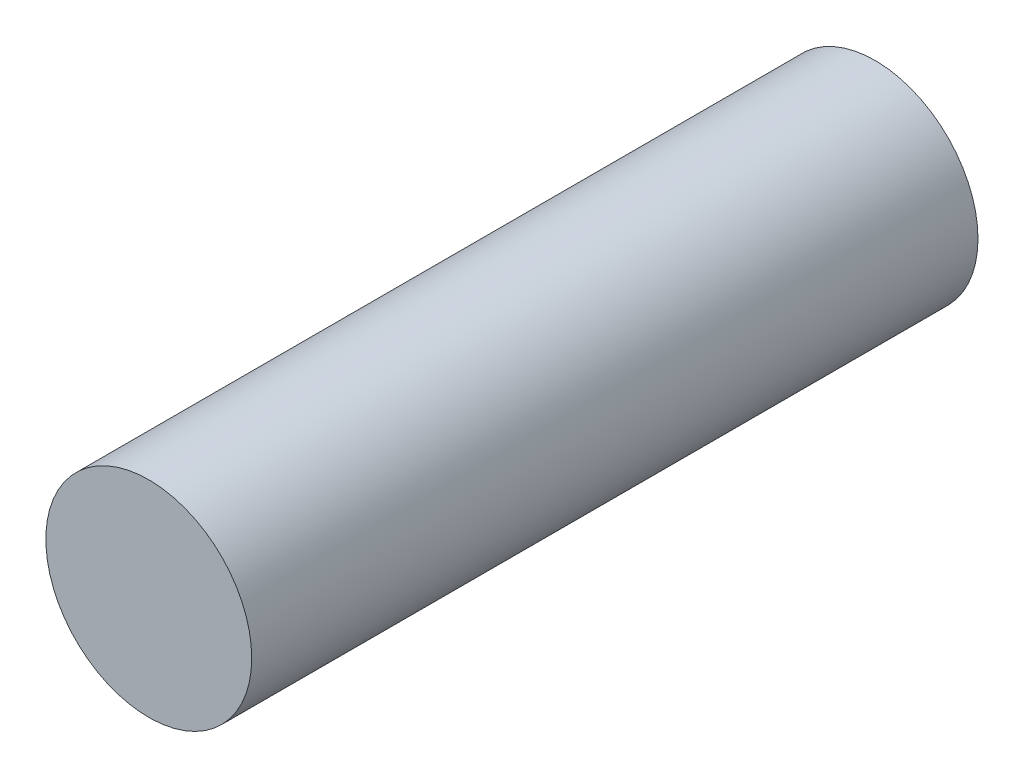
ISO-10303-21;
HEADER;
FILE_DESCRIPTION(('STEP AP214'),'2;1');
FILE_NAME('part.step','',(''),(''),'','','');
FILE_SCHEMA(('AUTOMOTIVE_DESIGN { 1 0 10303 214 1 1 1 1 }'));
ENDSEC;
DATA;
#1=APPLICATION_CONTEXT('core data for automotive mechanical design processes');
#2=APPLICATION_PROTOCOL_DEFINITION('international standard','automotive_design',2000,#1);
#3=PRODUCT_CONTEXT('',#1,'mechanical');
#4=PRODUCT('Part','Part','',(#3));
#5=PRODUCT_RELATED_PRODUCT_CATEGORY('part','',(#4));
#6=PRODUCT_DEFINITION_FORMATION('','',#4);
#7=PRODUCT_DEFINITION_CONTEXT('part definition',#1,'design');
#8=PRODUCT_DEFINITION('design','',#6,#7);
#9=PRODUCT_DEFINITION_SHAPE('','',#8);
#10=(LENGTH_UNIT() NAMED_UNIT(*) SI_UNIT(.MILLI.,.METRE.));
#11=(NAMED_UNIT(*) PLANE_ANGLE_UNIT() SI_UNIT($,.RADIAN.));
#12=(NAMED_UNIT(*) SI_UNIT($,.STERADIAN.) SOLID_ANGLE_UNIT());
#13=UNCERTAINTY_MEASURE_WITH_UNIT(LENGTH_MEASURE(1.E-05),#10,'distance_accuracy_value','');
#14=(GEOMETRIC_REPRESENTATION_CONTEXT(3) GLOBAL_UNCERTAINTY_ASSIGNED_CONTEXT((#13)) GLOBAL_UNIT_ASSIGNED_CONTEXT((#10,
#11,#12)) REPRESENTATION_CONTEXT('',''));
#15=CARTESIAN_POINT('',(0.,0.,0.));
#16=DIRECTION('',(0.,0.,1.));
#17=DIRECTION('',(1.,0.,0.));
#18=AXIS2_PLACEMENT_3D('',#15,#16,#17);
#19=CARTESIAN_POINT('',(0.,0.,50.34));
#20=DIRECTION('',(0.,0.,-1.));
#21=DIRECTION('',(-1.,0.,0.));
#22=AXIS2_PLACEMENT_3D('',#19,#20,#21);
#23=CYLINDRICAL_SURFACE('',#22,7.135);
#24=CARTESIAN_POINT('',(0.,0.,50.34));
#25=DIRECTION('',(0.,0.,1.));
#26=DIRECTION('',(1.,0.,0.));
#27=AXIS2_PLACEMENT_3D('',#24,#25,#26);
#28=CIRCLE('',#27,7.135);
#29=CARTESIAN_POINT('',(7.135,0.,50.34));
#30=VERTEX_POINT('',#29);
#31=EDGE_CURVE('E10',#30,#30,#28,.T.);
#32=ORIENTED_EDGE('',*,*,#31,.F.);
#33=EDGE_LOOP('',(#32));
#34=FACE_BOUND('',#33,.T.);
#35=CARTESIAN_POINT('',(0.,0.,0.));
#36=DIRECTION('',(0.,0.,1.));
#37=DIRECTION('',(1.,0.,0.));
#38=AXIS2_PLACEMENT_3D('',#35,#36,#37);
#39=CIRCLE('',#38,7.135);
#40=CARTESIAN_POINT('',(7.135,0.,0.));
#41=VERTEX_POINT('',#40);
#42=EDGE_CURVE('E36',#41,#41,#39,.T.);
#43=ORIENTED_EDGE('',*,*,#42,.T.);
#44=EDGE_LOOP('',(#43));
#45=FACE_BOUND('',#44,.T.);
#46=ADVANCED_FACE('F33',(#34,#45),#23,.T.);
#47=CARTESIAN_POINT('',(0.,0.,50.34));
#48=DIRECTION('',(0.,0.,1.));
#49=DIRECTION('',(1.,0.,0.));
#50=AXIS2_PLACEMENT_3D('',#47,#48,#49);
#51=PLANE('',#50);
#52=ORIENTED_EDGE('',*,*,#31,.T.);
#53=EDGE_LOOP('',(#52));
#54=FACE_BOUND('',#53,.T.);
#55=ADVANCED_FACE('F48',(#54),#51,.T.);
#56=CARTESIAN_POINT('',(0.,0.,0.));
#57=DIRECTION('',(0.,0.,1.));
#58=DIRECTION('',(1.,0.,0.));
#59=AXIS2_PLACEMENT_3D('',#56,#57,#58);
#60=PLANE('',#59);
#61=ORIENTED_EDGE('',*,*,#42,.F.);
#62=EDGE_LOOP('',(#61));
#63=FACE_BOUND('',#62,.T.);
#64=ADVANCED_FACE('F46',(#63),#60,.F.);
#65=CLOSED_SHELL('',(#46,#55,#64));
#66=MANIFOLD_SOLID_BREP('B2',#65);
#67=ADVANCED_BREP_SHAPE_REPRESENTATION('',(#18,#66),#14);
#68=SHAPE_DEFINITION_REPRESENTATION(#9,#67);
ENDSEC;
END-ISO-10303-21;
